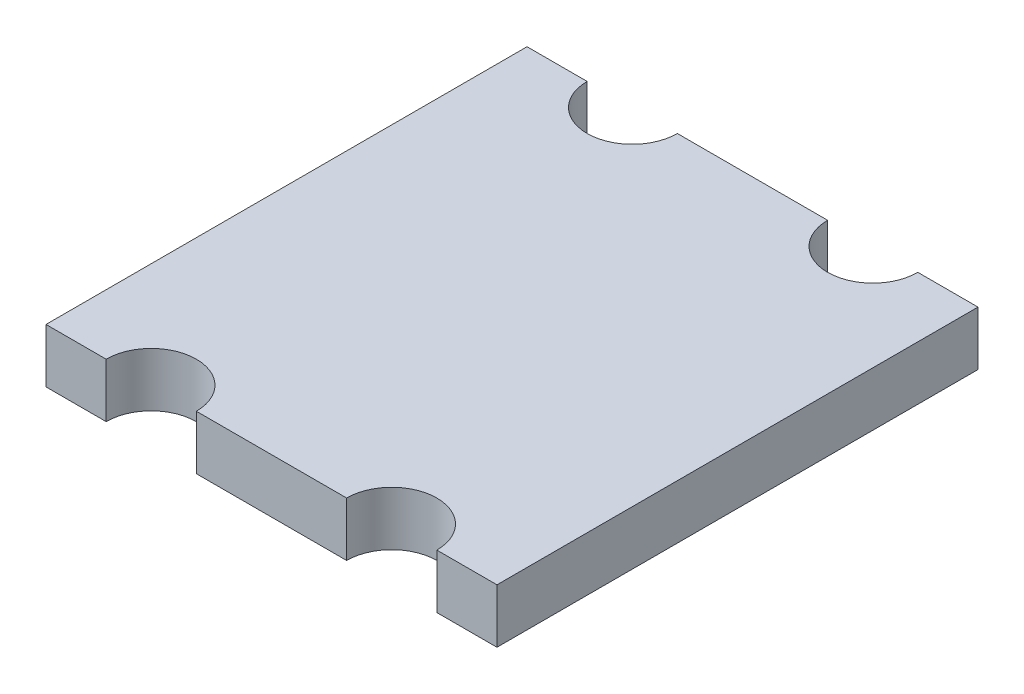
ISO-10303-21;
HEADER;
FILE_DESCRIPTION(('STEP AP214'),'2;1');
FILE_NAME('part.step','',(''),(''),'','','');
FILE_SCHEMA(('AUTOMOTIVE_DESIGN { 1 0 10303 214 1 1 1 1 }'));
ENDSEC;
DATA;
#1=APPLICATION_CONTEXT('core data for automotive mechanical design processes');
#2=APPLICATION_PROTOCOL_DEFINITION('international standard','automotive_design',2000,#1);
#3=PRODUCT_CONTEXT('',#1,'mechanical');
#4=PRODUCT('Part','Part','',(#3));
#5=PRODUCT_RELATED_PRODUCT_CATEGORY('part','',(#4));
#6=PRODUCT_DEFINITION_FORMATION('','',#4);
#7=PRODUCT_DEFINITION_CONTEXT('part definition',#1,'design');
#8=PRODUCT_DEFINITION('design','',#6,#7);
#9=PRODUCT_DEFINITION_SHAPE('','',#8);
#10=(LENGTH_UNIT() NAMED_UNIT(*) SI_UNIT(.MILLI.,.METRE.));
#11=(NAMED_UNIT(*) PLANE_ANGLE_UNIT() SI_UNIT($,.RADIAN.));
#12=(NAMED_UNIT(*) SI_UNIT($,.STERADIAN.) SOLID_ANGLE_UNIT());
#13=UNCERTAINTY_MEASURE_WITH_UNIT(LENGTH_MEASURE(1.E-05),#10,'distance_accuracy_value','');
#14=(GEOMETRIC_REPRESENTATION_CONTEXT(3) GLOBAL_UNCERTAINTY_ASSIGNED_CONTEXT((#13)) GLOBAL_UNIT_ASSIGNED_CONTEXT((#10,
#11,#12)) REPRESENTATION_CONTEXT('',''));
#15=CARTESIAN_POINT('',(0.,0.,0.));
#16=DIRECTION('',(0.,0.,1.));
#17=DIRECTION('',(1.,0.,0.));
#18=AXIS2_PLACEMENT_3D('',#15,#16,#17);
#19=CARTESIAN_POINT('',(0.42,-1.03,-32.3));
#20=DIRECTION('',(0.,-1.,0.));
#21=DIRECTION('',(1.,0.,0.));
#22=AXIS2_PLACEMENT_3D('',#19,#20,#21);
#23=PLANE('',#22);
#24=CARTESIAN_POINT('',(0.77,-1.03,-32.3));
#25=DIRECTION('',(0.,1.,0.));
#26=DIRECTION('',(0.,0.,1.));
#27=AXIS2_PLACEMENT_3D('',#24,#25,#26);
#28=CIRCLE('',#27,0.15);
#29=CARTESIAN_POINT('',(0.62,-1.03,-32.3));
#30=VERTEX_POINT('',#29);
#31=CARTESIAN_POINT('',(0.92,-1.03,-32.3));
#32=VERTEX_POINT('',#31);
#33=EDGE_CURVE('E21',#30,#32,#28,.T.);
#34=ORIENTED_EDGE('',*,*,#33,.T.);
#35=DIRECTION('',(1.,0.,0.));
#36=VECTOR('',#35,1.);
#37=CARTESIAN_POINT('',(1.17,-1.03,-32.3));
#38=LINE('',#37,#36);
#39=CARTESIAN_POINT('',(1.42,-1.03,-32.3));
#40=VERTEX_POINT('',#39);
#41=EDGE_CURVE('E93',#32,#40,#38,.T.);
#42=ORIENTED_EDGE('',*,*,#41,.T.);
#43=CARTESIAN_POINT('',(1.57,-1.03,-32.3));
#44=DIRECTION('',(0.,-1.,0.));
#45=DIRECTION('',(0.,0.,-1.));
#46=AXIS2_PLACEMENT_3D('',#43,#44,#45);
#47=CIRCLE('',#46,0.15);
#48=CARTESIAN_POINT('',(1.72,-1.03,-32.3));
#49=VERTEX_POINT('',#48);
#50=EDGE_CURVE('E105',#49,#40,#47,.T.);
#51=ORIENTED_EDGE('',*,*,#50,.F.);
#52=DIRECTION('',(-1.,0.,0.));
#53=VECTOR('',#52,1.);
#54=CARTESIAN_POINT('',(1.17,-1.03,-32.3));
#55=LINE('',#54,#53);
#56=CARTESIAN_POINT('',(1.92,-1.03,-32.3));
#57=VERTEX_POINT('',#56);
#58=EDGE_CURVE('E130',#57,#49,#55,.T.);
#59=ORIENTED_EDGE('',*,*,#58,.F.);
#60=DIRECTION('',(0.,0.,-1.));
#61=VECTOR('',#60,1.);
#62=CARTESIAN_POINT('',(1.92,-1.03,-31.5));
#63=LINE('',#62,#61);
#64=CARTESIAN_POINT('',(1.92,-1.03,-30.7));
#65=VERTEX_POINT('',#64);
#66=EDGE_CURVE('E127',#65,#57,#63,.T.);
#67=ORIENTED_EDGE('',*,*,#66,.F.);
#68=DIRECTION('',(1.,0.,0.));
#69=VECTOR('',#68,1.);
#70=CARTESIAN_POINT('',(1.17,-1.03,-30.7));
#71=LINE('',#70,#69);
#72=CARTESIAN_POINT('',(1.72,-1.03,-30.7));
#73=VERTEX_POINT('',#72);
#74=EDGE_CURVE('E120',#73,#65,#71,.T.);
#75=ORIENTED_EDGE('',*,*,#74,.F.);
#76=CARTESIAN_POINT('',(1.57,-1.03,-30.7));
#77=DIRECTION('',(0.,1.,0.));
#78=DIRECTION('',(0.,0.,1.));
#79=AXIS2_PLACEMENT_3D('',#76,#77,#78);
#80=CIRCLE('',#79,0.15);
#81=CARTESIAN_POINT('',(1.42,-1.03,-30.7));
#82=VERTEX_POINT('',#81);
#83=EDGE_CURVE('E153',#82,#73,#80,.F.);
#84=ORIENTED_EDGE('',*,*,#83,.F.);
#85=DIRECTION('',(1.,0.,0.));
#86=VECTOR('',#85,1.);
#87=CARTESIAN_POINT('',(1.17,-1.03,-30.7));
#88=LINE('',#87,#86);
#89=CARTESIAN_POINT('',(0.92,-1.03,-30.7));
#90=VERTEX_POINT('',#89);
#91=EDGE_CURVE('E115',#90,#82,#88,.T.);
#92=ORIENTED_EDGE('',*,*,#91,.F.);
#93=CARTESIAN_POINT('',(0.77,-1.03,-30.7));
#94=DIRECTION('',(0.,-1.,0.));
#95=DIRECTION('',(0.,0.,-1.));
#96=AXIS2_PLACEMENT_3D('',#93,#94,#95);
#97=CIRCLE('',#96,0.15);
#98=CARTESIAN_POINT('',(0.62,-1.03,-30.7));
#99=VERTEX_POINT('',#98);
#100=EDGE_CURVE('E118',#99,#90,#97,.T.);
#101=ORIENTED_EDGE('',*,*,#100,.F.);
#102=DIRECTION('',(1.,0.,0.));
#103=VECTOR('',#102,1.);
#104=CARTESIAN_POINT('',(1.17,-1.03,-30.7));
#105=LINE('',#104,#103);
#106=CARTESIAN_POINT('',(0.42,-1.03,-30.7));
#107=VERTEX_POINT('',#106);
#108=EDGE_CURVE('E183',#107,#99,#105,.T.);
#109=ORIENTED_EDGE('',*,*,#108,.F.);
#110=DIRECTION('',(0.,0.,1.));
#111=VECTOR('',#110,1.);
#112=CARTESIAN_POINT('',(0.42,-1.03,-31.5));
#113=LINE('',#112,#111);
#114=CARTESIAN_POINT('',(0.42,-1.03,-32.3));
#115=VERTEX_POINT('',#114);
#116=EDGE_CURVE('E179',#115,#107,#113,.T.);
#117=ORIENTED_EDGE('',*,*,#116,.F.);
#118=DIRECTION('',(1.,0.,0.));
#119=VECTOR('',#118,1.);
#120=CARTESIAN_POINT('',(1.17,-1.03,-32.3));
#121=LINE('',#120,#119);
#122=EDGE_CURVE('E90',#115,#30,#121,.T.);
#123=ORIENTED_EDGE('',*,*,#122,.T.);
#124=EDGE_LOOP('',(#34,#42,#51,#59,#67,#75,#84,#92,#101,#109,#117,#123));
#125=FACE_BOUND('',#124,.T.);
#126=ADVANCED_FACE('F17',(#125),#23,.T.);
#127=CARTESIAN_POINT('',(1.57,-0.85,-32.3));
#128=DIRECTION('',(0.,-1.,0.));
#129=DIRECTION('',(0.,0.,-1.));
#130=AXIS2_PLACEMENT_3D('',#127,#128,#129);
#131=CYLINDRICAL_SURFACE('',#130,0.15);
#132=ORIENTED_EDGE('',*,*,#50,.T.);
#133=DIRECTION('',(0.,-1.,0.));
#134=VECTOR('',#133,1.);
#135=CARTESIAN_POINT('',(1.42,-0.94,-32.3));
#136=LINE('',#135,#134);
#137=CARTESIAN_POINT('',(1.42,-0.85,-32.3));
#138=VERTEX_POINT('',#137);
#139=EDGE_CURVE('E100',#138,#40,#136,.T.);
#140=ORIENTED_EDGE('',*,*,#139,.F.);
#141=CARTESIAN_POINT('',(1.57,-0.85,-32.3));
#142=DIRECTION('',(0.,-1.,0.));
#143=DIRECTION('',(0.,0.,-1.));
#144=AXIS2_PLACEMENT_3D('',#141,#142,#143);
#145=CIRCLE('',#144,0.15);
#146=CARTESIAN_POINT('',(1.72,-0.85,-32.3));
#147=VERTEX_POINT('',#146);
#148=EDGE_CURVE('E99',#138,#147,#145,.F.);
#149=ORIENTED_EDGE('',*,*,#148,.T.);
#150=DIRECTION('',(0.,1.,0.));
#151=VECTOR('',#150,1.);
#152=CARTESIAN_POINT('',(1.72,-0.94,-32.3));
#153=LINE('',#152,#151);
#154=EDGE_CURVE('E107',#49,#147,#153,.T.);
#155=ORIENTED_EDGE('',*,*,#154,.F.);
#156=EDGE_LOOP('',(#132,#140,#149,#155));
#157=FACE_BOUND('',#156,.T.);
#158=ADVANCED_FACE('F265',(#157),#131,.F.);
#159=CARTESIAN_POINT('',(0.42,-0.85,-32.3));
#160=DIRECTION('',(0.,0.,-1.));
#161=DIRECTION('',(1.,0.,0.));
#162=AXIS2_PLACEMENT_3D('',#159,#160,#161);
#163=PLANE('',#162);
#164=DIRECTION('',(0.,1.,0.));
#165=VECTOR('',#164,1.);
#166=CARTESIAN_POINT('',(1.92,-0.94,-32.3));
#167=LINE('',#166,#165);
#168=CARTESIAN_POINT('',(1.92,-0.85,-32.3));
#169=VERTEX_POINT('',#168);
#170=EDGE_CURVE('E124',#57,#169,#167,.T.);
#171=ORIENTED_EDGE('',*,*,#170,.F.);
#172=ORIENTED_EDGE('',*,*,#58,.T.);
#173=ORIENTED_EDGE('',*,*,#154,.T.);
#174=DIRECTION('',(1.,0.,0.));
#175=VECTOR('',#174,1.);
#176=CARTESIAN_POINT('',(1.17,-0.85,-32.3));
#177=LINE('',#176,#175);
#178=EDGE_CURVE('E150',#147,#169,#177,.T.);
#179=ORIENTED_EDGE('',*,*,#178,.T.);
#180=EDGE_LOOP('',(#171,#172,#173,#179));
#181=FACE_BOUND('',#180,.T.);
#182=ADVANCED_FACE('F262',(#181),#163,.T.);
#183=CARTESIAN_POINT('',(1.92,-0.85,-32.3));
#184=DIRECTION('',(1.,0.,0.));
#185=DIRECTION('',(0.,0.,1.));
#186=AXIS2_PLACEMENT_3D('',#183,#184,#185);
#187=PLANE('',#186);
#188=ORIENTED_EDGE('',*,*,#66,.T.);
#189=ORIENTED_EDGE('',*,*,#170,.T.);
#190=DIRECTION('',(0.,0.,1.));
#191=VECTOR('',#190,1.);
#192=CARTESIAN_POINT('',(1.92,-0.85,-31.5));
#193=LINE('',#192,#191);
#194=CARTESIAN_POINT('',(1.92,-0.85,-30.7));
#195=VERTEX_POINT('',#194);
#196=EDGE_CURVE('E169',#169,#195,#193,.T.);
#197=ORIENTED_EDGE('',*,*,#196,.T.);
#198=DIRECTION('',(0.,1.,0.));
#199=VECTOR('',#198,1.);
#200=CARTESIAN_POINT('',(1.92,-0.94,-30.7));
#201=LINE('',#200,#199);
#202=EDGE_CURVE('E123',#65,#195,#201,.T.);
#203=ORIENTED_EDGE('',*,*,#202,.F.);
#204=EDGE_LOOP('',(#188,#189,#197,#203));
#205=FACE_BOUND('',#204,.T.);
#206=ADVANCED_FACE('F258',(#205),#187,.T.);
#207=CARTESIAN_POINT('',(1.92,-0.85,-30.7));
#208=DIRECTION('',(0.,0.,1.));
#209=DIRECTION('',(-1.,0.,0.));
#210=AXIS2_PLACEMENT_3D('',#207,#208,#209);
#211=PLANE('',#210);
#212=ORIENTED_EDGE('',*,*,#202,.T.);
#213=DIRECTION('',(-1.,0.,0.));
#214=VECTOR('',#213,1.);
#215=CARTESIAN_POINT('',(1.17,-0.85,-30.7));
#216=LINE('',#215,#214);
#217=CARTESIAN_POINT('',(1.72,-0.85,-30.7));
#218=VERTEX_POINT('',#217);
#219=EDGE_CURVE('E147',#195,#218,#216,.T.);
#220=ORIENTED_EDGE('',*,*,#219,.T.);
#221=DIRECTION('',(0.,1.,0.));
#222=VECTOR('',#221,1.);
#223=CARTESIAN_POINT('',(1.72,-0.94,-30.7));
#224=LINE('',#223,#222);
#225=EDGE_CURVE('E154',#73,#218,#224,.T.);
#226=ORIENTED_EDGE('',*,*,#225,.F.);
#227=ORIENTED_EDGE('',*,*,#74,.T.);
#228=EDGE_LOOP('',(#212,#220,#226,#227));
#229=FACE_BOUND('',#228,.T.);
#230=ADVANCED_FACE('F210',(#229),#211,.T.);
#231=CARTESIAN_POINT('',(1.57,-1.03,-30.7));
#232=DIRECTION('',(0.,1.,0.));
#233=DIRECTION('',(0.,0.,1.));
#234=AXIS2_PLACEMENT_3D('',#231,#232,#233);
#235=CYLINDRICAL_SURFACE('',#234,0.15);
#236=ORIENTED_EDGE('',*,*,#83,.T.);
#237=ORIENTED_EDGE('',*,*,#225,.T.);
#238=CARTESIAN_POINT('',(1.57,-0.85,-30.7));
#239=DIRECTION('',(0.,1.,0.));
#240=DIRECTION('',(0.,0.,1.));
#241=AXIS2_PLACEMENT_3D('',#238,#239,#240);
#242=CIRCLE('',#241,0.15);
#243=CARTESIAN_POINT('',(1.42,-0.85,-30.7));
#244=VERTEX_POINT('',#243);
#245=EDGE_CURVE('E144',#218,#244,#242,.T.);
#246=ORIENTED_EDGE('',*,*,#245,.T.);
#247=DIRECTION('',(0.,1.,0.));
#248=VECTOR('',#247,1.);
#249=CARTESIAN_POINT('',(1.42,-0.94,-30.7));
#250=LINE('',#249,#248);
#251=EDGE_CURVE('E119',#82,#244,#250,.T.);
#252=ORIENTED_EDGE('',*,*,#251,.F.);
#253=EDGE_LOOP('',(#236,#237,#246,#252));
#254=FACE_BOUND('',#253,.T.);
#255=ADVANCED_FACE('F208',(#254),#235,.F.);
#256=CARTESIAN_POINT('',(1.92,-0.85,-30.7));
#257=DIRECTION('',(0.,0.,1.));
#258=DIRECTION('',(-1.,0.,0.));
#259=AXIS2_PLACEMENT_3D('',#256,#257,#258);
#260=PLANE('',#259);
#261=DIRECTION('',(0.,1.,0.));
#262=VECTOR('',#261,1.);
#263=CARTESIAN_POINT('',(0.92,-0.94,-30.6999999999999));
#264=LINE('',#263,#262);
#265=CARTESIAN_POINT('',(0.92,-0.85,-30.7));
#266=VERTEX_POINT('',#265);
#267=EDGE_CURVE('E152',#90,#266,#264,.T.);
#268=ORIENTED_EDGE('',*,*,#267,.F.);
#269=ORIENTED_EDGE('',*,*,#91,.T.);
#270=ORIENTED_EDGE('',*,*,#251,.T.);
#271=DIRECTION('',(-1.,0.,0.));
#272=VECTOR('',#271,1.);
#273=CARTESIAN_POINT('',(1.17,-0.85,-30.7));
#274=LINE('',#273,#272);
#275=EDGE_CURVE('E143',#244,#266,#274,.T.);
#276=ORIENTED_EDGE('',*,*,#275,.T.);
#277=EDGE_LOOP('',(#268,#269,#270,#276));
#278=FACE_BOUND('',#277,.T.);
#279=ADVANCED_FACE('F202',(#278),#260,.T.);
#280=CARTESIAN_POINT('',(0.77,-0.85,-30.7));
#281=DIRECTION('',(0.,-1.,0.));
#282=DIRECTION('',(0.,0.,-1.));
#283=AXIS2_PLACEMENT_3D('',#280,#281,#282);
#284=CYLINDRICAL_SURFACE('',#283,0.15);
#285=ORIENTED_EDGE('',*,*,#100,.T.);
#286=ORIENTED_EDGE('',*,*,#267,.T.);
#287=CARTESIAN_POINT('',(0.77,-0.85,-30.7));
#288=DIRECTION('',(0.,-1.,0.));
#289=DIRECTION('',(0.,0.,-1.));
#290=AXIS2_PLACEMENT_3D('',#287,#288,#289);
#291=CIRCLE('',#290,0.15);
#292=CARTESIAN_POINT('',(0.62,-0.85,-30.7));
#293=VERTEX_POINT('',#292);
#294=EDGE_CURVE('E139',#266,#293,#291,.F.);
#295=ORIENTED_EDGE('',*,*,#294,.T.);
#296=DIRECTION('',(0.,1.,0.));
#297=VECTOR('',#296,1.);
#298=CARTESIAN_POINT('',(0.62,-0.94,-30.7));
#299=LINE('',#298,#297);
#300=EDGE_CURVE('E186',#99,#293,#299,.T.);
#301=ORIENTED_EDGE('',*,*,#300,.F.);
#302=EDGE_LOOP('',(#285,#286,#295,#301));
#303=FACE_BOUND('',#302,.T.);
#304=ADVANCED_FACE('F267',(#303),#284,.F.);
#305=CARTESIAN_POINT('',(1.92,-0.85,-30.7));
#306=DIRECTION('',(0.,0.,1.));
#307=DIRECTION('',(-1.,0.,0.));
#308=AXIS2_PLACEMENT_3D('',#305,#306,#307);
#309=PLANE('',#308);
#310=DIRECTION('',(0.,1.,0.));
#311=VECTOR('',#310,1.);
#312=CARTESIAN_POINT('',(0.42,-0.94,-30.7));
#313=LINE('',#312,#311);
#314=CARTESIAN_POINT('',(0.42,-0.85,-30.7));
#315=VERTEX_POINT('',#314);
#316=EDGE_CURVE('E182',#107,#315,#313,.T.);
#317=ORIENTED_EDGE('',*,*,#316,.F.);
#318=ORIENTED_EDGE('',*,*,#108,.T.);
#319=ORIENTED_EDGE('',*,*,#300,.T.);
#320=DIRECTION('',(-1.,0.,0.));
#321=VECTOR('',#320,1.);
#322=CARTESIAN_POINT('',(1.17,-0.85,-30.7));
#323=LINE('',#322,#321);
#324=EDGE_CURVE('E142',#293,#315,#323,.T.);
#325=ORIENTED_EDGE('',*,*,#324,.T.);
#326=EDGE_LOOP('',(#317,#318,#319,#325));
#327=FACE_BOUND('',#326,.T.);
#328=ADVANCED_FACE('F242',(#327),#309,.T.);
#329=CARTESIAN_POINT('',(0.42,-0.85,-30.7));
#330=DIRECTION('',(-1.,0.,0.));
#331=DIRECTION('',(0.,0.,-1.));
#332=AXIS2_PLACEMENT_3D('',#329,#330,#331);
#333=PLANE('',#332);
#334=ORIENTED_EDGE('',*,*,#116,.T.);
#335=ORIENTED_EDGE('',*,*,#316,.T.);
#336=DIRECTION('',(0.,0.,-1.));
#337=VECTOR('',#336,1.);
#338=CARTESIAN_POINT('',(0.42,-0.85,-31.5));
#339=LINE('',#338,#337);
#340=CARTESIAN_POINT('',(0.42,-0.85,-32.3));
#341=VERTEX_POINT('',#340);
#342=EDGE_CURVE('E230',#315,#341,#339,.T.);
#343=ORIENTED_EDGE('',*,*,#342,.T.);
#344=DIRECTION('',(0.,1.,0.));
#345=VECTOR('',#344,1.);
#346=CARTESIAN_POINT('',(0.42,-0.94,-32.3));
#347=LINE('',#346,#345);
#348=EDGE_CURVE('E225',#115,#341,#347,.T.);
#349=ORIENTED_EDGE('',*,*,#348,.F.);
#350=EDGE_LOOP('',(#334,#335,#343,#349));
#351=FACE_BOUND('',#350,.T.);
#352=ADVANCED_FACE('F237',(#351),#333,.T.);
#353=CARTESIAN_POINT('',(0.42,-0.85,-32.3));
#354=DIRECTION('',(0.,0.,-1.));
#355=DIRECTION('',(1.,0.,0.));
#356=AXIS2_PLACEMENT_3D('',#353,#354,#355);
#357=PLANE('',#356);
#358=ORIENTED_EDGE('',*,*,#348,.T.);
#359=DIRECTION('',(1.,0.,0.));
#360=VECTOR('',#359,1.);
#361=CARTESIAN_POINT('',(1.17,-0.85,-32.3));
#362=LINE('',#361,#360);
#363=CARTESIAN_POINT('',(0.62,-0.85,-32.3));
#364=VERTEX_POINT('',#363);
#365=EDGE_CURVE('E138',#341,#364,#362,.T.);
#366=ORIENTED_EDGE('',*,*,#365,.T.);
#367=DIRECTION('',(0.,1.,0.));
#368=VECTOR('',#367,1.);
#369=CARTESIAN_POINT('',(0.62,-0.94,-32.3));
#370=LINE('',#369,#368);
#371=EDGE_CURVE('E223',#30,#364,#370,.T.);
#372=ORIENTED_EDGE('',*,*,#371,.F.);
#373=ORIENTED_EDGE('',*,*,#122,.F.);
#374=EDGE_LOOP('',(#358,#366,#372,#373));
#375=FACE_BOUND('',#374,.T.);
#376=ADVANCED_FACE('F249',(#375),#357,.T.);
#377=CARTESIAN_POINT('',(0.77,-1.03,-32.3));
#378=DIRECTION('',(0.,1.,0.));
#379=DIRECTION('',(0.,0.,1.));
#380=AXIS2_PLACEMENT_3D('',#377,#378,#379);
#381=CYLINDRICAL_SURFACE('',#380,0.15);
#382=ORIENTED_EDGE('',*,*,#33,.F.);
#383=ORIENTED_EDGE('',*,*,#371,.T.);
#384=CARTESIAN_POINT('',(0.77,-0.85,-32.3));
#385=DIRECTION('',(0.,1.,0.));
#386=DIRECTION('',(0.,0.,1.));
#387=AXIS2_PLACEMENT_3D('',#384,#385,#386);
#388=CIRCLE('',#387,0.15);
#389=CARTESIAN_POINT('',(0.92,-0.85,-32.3));
#390=VERTEX_POINT('',#389);
#391=EDGE_CURVE('E27',#364,#390,#388,.T.);
#392=ORIENTED_EDGE('',*,*,#391,.T.);
#393=DIRECTION('',(0.,1.,0.));
#394=VECTOR('',#393,1.);
#395=CARTESIAN_POINT('',(0.92,-0.94,-32.3));
#396=LINE('',#395,#394);
#397=EDGE_CURVE('E35',#32,#390,#396,.T.);
#398=ORIENTED_EDGE('',*,*,#397,.F.);
#399=EDGE_LOOP('',(#382,#383,#392,#398));
#400=FACE_BOUND('',#399,.T.);
#401=ADVANCED_FACE('F97',(#400),#381,.F.);
#402=CARTESIAN_POINT('',(0.42,-0.85,-32.3));
#403=DIRECTION('',(0.,0.,-1.));
#404=DIRECTION('',(1.,0.,0.));
#405=AXIS2_PLACEMENT_3D('',#402,#403,#404);
#406=PLANE('',#405);
#407=ORIENTED_EDGE('',*,*,#397,.T.);
#408=DIRECTION('',(1.,0.,0.));
#409=VECTOR('',#408,1.);
#410=CARTESIAN_POINT('',(1.17,-0.85,-32.3));
#411=LINE('',#410,#409);
#412=EDGE_CURVE('E11',#390,#138,#411,.T.);
#413=ORIENTED_EDGE('',*,*,#412,.T.);
#414=ORIENTED_EDGE('',*,*,#139,.T.);
#415=ORIENTED_EDGE('',*,*,#41,.F.);
#416=EDGE_LOOP('',(#407,#413,#414,#415));
#417=FACE_BOUND('',#416,.T.);
#418=ADVANCED_FACE('F103',(#417),#406,.T.);
#419=CARTESIAN_POINT('',(0.42,-0.85,-32.3));
#420=DIRECTION('',(0.,-1.,0.));
#421=DIRECTION('',(1.,0.,0.));
#422=AXIS2_PLACEMENT_3D('',#419,#420,#421);
#423=PLANE('',#422);
#424=ORIENTED_EDGE('',*,*,#391,.F.);
#425=ORIENTED_EDGE('',*,*,#365,.F.);
#426=ORIENTED_EDGE('',*,*,#342,.F.);
#427=ORIENTED_EDGE('',*,*,#324,.F.);
#428=ORIENTED_EDGE('',*,*,#294,.F.);
#429=ORIENTED_EDGE('',*,*,#275,.F.);
#430=ORIENTED_EDGE('',*,*,#245,.F.);
#431=ORIENTED_EDGE('',*,*,#219,.F.);
#432=ORIENTED_EDGE('',*,*,#196,.F.);
#433=ORIENTED_EDGE('',*,*,#178,.F.);
#434=ORIENTED_EDGE('',*,*,#148,.F.);
#435=ORIENTED_EDGE('',*,*,#412,.F.);
#436=EDGE_LOOP('',(#424,#425,#426,#427,#428,#429,#430,#431,#432,#433,#434,#435));
#437=FACE_BOUND('',#436,.T.);
#438=ADVANCED_FACE('F19',(#437),#423,.F.);
#439=CLOSED_SHELL('',(#126,#158,#182,#206,#230,#255,#279,#304,#328,#352,#376,#401,#418,#438));
#440=MANIFOLD_SOLID_BREP('B1',#439);
#441=ADVANCED_BREP_SHAPE_REPRESENTATION('',(#18,#440),#14);
#442=SHAPE_DEFINITION_REPRESENTATION(#9,#441);
ENDSEC;
END-ISO-10303-21;
